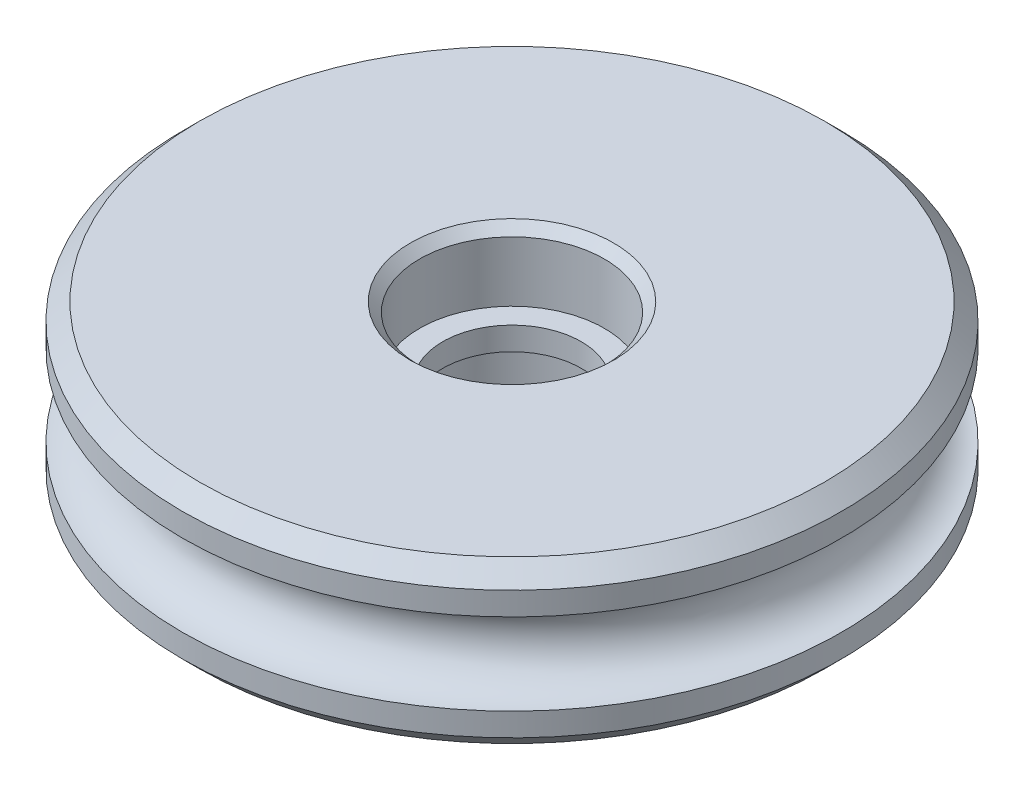
ISO-10303-21;
HEADER;
FILE_DESCRIPTION(('STEP AP214'),'2;1');
FILE_NAME('part.step','',(''),(''),'','','');
FILE_SCHEMA(('AUTOMOTIVE_DESIGN { 1 0 10303 214 1 1 1 1 }'));
ENDSEC;
DATA;
#1=APPLICATION_CONTEXT('core data for automotive mechanical design processes');
#2=APPLICATION_PROTOCOL_DEFINITION('international standard','automotive_design',2000,#1);
#3=PRODUCT_CONTEXT('',#1,'mechanical');
#4=PRODUCT('Part','Part','',(#3));
#5=PRODUCT_RELATED_PRODUCT_CATEGORY('part','',(#4));
#6=PRODUCT_DEFINITION_FORMATION('','',#4);
#7=PRODUCT_DEFINITION_CONTEXT('part definition',#1,'design');
#8=PRODUCT_DEFINITION('design','',#6,#7);
#9=PRODUCT_DEFINITION_SHAPE('','',#8);
#10=(LENGTH_UNIT() NAMED_UNIT(*) SI_UNIT(.MILLI.,.METRE.));
#11=(NAMED_UNIT(*) PLANE_ANGLE_UNIT() SI_UNIT($,.RADIAN.));
#12=(NAMED_UNIT(*) SI_UNIT($,.STERADIAN.) SOLID_ANGLE_UNIT());
#13=UNCERTAINTY_MEASURE_WITH_UNIT(LENGTH_MEASURE(1.E-05),#10,'distance_accuracy_value','');
#14=(GEOMETRIC_REPRESENTATION_CONTEXT(3) GLOBAL_UNCERTAINTY_ASSIGNED_CONTEXT((#13)) GLOBAL_UNIT_ASSIGNED_CONTEXT((#10,
#11,#12)) REPRESENTATION_CONTEXT('',''));
#15=CARTESIAN_POINT('',(0.,0.,0.));
#16=DIRECTION('',(0.,0.,1.));
#17=DIRECTION('',(1.,0.,0.));
#18=AXIS2_PLACEMENT_3D('',#15,#16,#17);
#19=CARTESIAN_POINT('',(0.,19.0174021430808,0.));
#20=DIRECTION('',(0.,1.,0.));
#21=DIRECTION('',(0.,0.,1.));
#22=AXIS2_PLACEMENT_3D('',#19,#20,#21);
#23=CYLINDRICAL_SURFACE('',#22,4.);
#24=CARTESIAN_POINT('',(0.,3.10000000000001,0.));
#25=DIRECTION('',(0.,1.,0.));
#26=DIRECTION('',(0.,0.,1.));
#27=AXIS2_PLACEMENT_3D('',#24,#25,#26);
#28=CIRCLE('',#27,4.);
#29=CARTESIAN_POINT('',(0.,3.10000000000001,4.));
#30=VERTEX_POINT('',#29);
#31=EDGE_CURVE('E62',#30,#30,#28,.T.);
#32=ORIENTED_EDGE('',*,*,#31,.T.);
#33=EDGE_LOOP('',(#32));
#34=FACE_BOUND('',#33,.T.);
#35=CARTESIAN_POINT('',(0.,0.5,0.));
#36=DIRECTION('',(0.,1.,0.));
#37=DIRECTION('',(0.,0.,1.));
#38=AXIS2_PLACEMENT_3D('',#35,#36,#37);
#39=CIRCLE('',#38,4.);
#40=CARTESIAN_POINT('',(0.,0.5,4.));
#41=VERTEX_POINT('',#40);
#42=EDGE_CURVE('E84',#41,#41,#39,.T.);
#43=ORIENTED_EDGE('',*,*,#42,.F.);
#44=EDGE_LOOP('',(#43));
#45=FACE_BOUND('',#44,.T.);
#46=ADVANCED_FACE('F43',(#34,#45),#23,.F.);
#47=CARTESIAN_POINT('',(0.,3.5,4.));
#48=DIRECTION('',(0.,1.,0.));
#49=DIRECTION('',(0.,0.,1.));
#50=AXIS2_PLACEMENT_3D('',#47,#48,#49);
#51=PLANE('',#50);
#52=CARTESIAN_POINT('',(0.,3.5,0.));
#53=DIRECTION('',(0.,1.,0.));
#54=DIRECTION('',(0.,0.,1.));
#55=AXIS2_PLACEMENT_3D('',#52,#53,#54);
#56=CIRCLE('',#55,4.4);
#57=CARTESIAN_POINT('',(0.,3.5,4.4));
#58=VERTEX_POINT('',#57);
#59=EDGE_CURVE('E57',#58,#58,#56,.F.);
#60=ORIENTED_EDGE('',*,*,#59,.T.);
#61=EDGE_LOOP('',(#60));
#62=FACE_BOUND('',#61,.T.);
#63=CARTESIAN_POINT('',(0.,3.5,0.));
#64=DIRECTION('',(0.,1.,0.));
#65=DIRECTION('',(0.,0.,1.));
#66=AXIS2_PLACEMENT_3D('',#63,#64,#65);
#67=CIRCLE('',#66,13.5274);
#68=CARTESIAN_POINT('',(0.,3.5,13.5274));
#69=VERTEX_POINT('',#68);
#70=EDGE_CURVE('E68',#69,#69,#67,.T.);
#71=ORIENTED_EDGE('',*,*,#70,.T.);
#72=EDGE_LOOP('',(#71));
#73=FACE_BOUND('',#72,.T.);
#74=ADVANCED_FACE('F135',(#62,#73),#51,.T.);
#75=CARTESIAN_POINT('',(0.,3.5,0.));
#76=DIRECTION('',(0.,-1.,0.));
#77=DIRECTION('',(0.,0.,-1.));
#78=AXIS2_PLACEMENT_3D('',#75,#76,#77);
#79=CONICAL_SURFACE('',#78,13.5274,0.785398163397453);
#80=CARTESIAN_POINT('',(0.,2.7653,0.));
#81=DIRECTION('',(0.,1.,0.));
#82=DIRECTION('',(0.,0.,1.));
#83=AXIS2_PLACEMENT_3D('',#80,#81,#82);
#84=CIRCLE('',#83,14.2621);
#85=CARTESIAN_POINT('',(0.,2.7653,14.2621));
#86=VERTEX_POINT('',#85);
#87=EDGE_CURVE('E72',#86,#86,#84,.T.);
#88=ORIENTED_EDGE('',*,*,#87,.T.);
#89=EDGE_LOOP('',(#88));
#90=FACE_BOUND('',#89,.T.);
#91=ORIENTED_EDGE('',*,*,#70,.F.);
#92=EDGE_LOOP('',(#91));
#93=FACE_BOUND('',#92,.T.);
#94=ADVANCED_FACE('F141',(#90,#93),#79,.T.);
#95=CARTESIAN_POINT('',(0.,19.0174021430808,0.));
#96=DIRECTION('',(0.,1.,0.));
#97=DIRECTION('',(0.,0.,1.));
#98=AXIS2_PLACEMENT_3D('',#95,#96,#97);
#99=CYLINDRICAL_SURFACE('',#98,14.2621);
#100=CARTESIAN_POINT('',(0.,1.7653,0.));
#101=DIRECTION('',(0.,1.,0.));
#102=DIRECTION('',(0.,0.,1.));
#103=AXIS2_PLACEMENT_3D('',#100,#101,#102);
#104=CIRCLE('',#103,14.2621);
#105=CARTESIAN_POINT('',(0.,1.7653,14.2621));
#106=VERTEX_POINT('',#105);
#107=EDGE_CURVE('E76',#106,#106,#104,.T.);
#108=ORIENTED_EDGE('',*,*,#107,.T.);
#109=EDGE_LOOP('',(#108));
#110=FACE_BOUND('',#109,.T.);
#111=ORIENTED_EDGE('',*,*,#87,.F.);
#112=EDGE_LOOP('',(#111));
#113=FACE_BOUND('',#112,.T.);
#114=ADVANCED_FACE('F131',(#110,#113),#99,.T.);
#115=CARTESIAN_POINT('',(0.,0.,0.));
#116=DIRECTION('',(0.,1.,0.));
#117=DIRECTION('',(0.,0.,1.));
#118=AXIS2_PLACEMENT_3D('',#115,#116,#117);
#119=TOROIDAL_SURFACE('',#118,14.2621,1.7653);
#120=ORIENTED_EDGE('',*,*,#107,.F.);
#121=EDGE_LOOP('',(#120));
#122=FACE_BOUND('',#121,.T.);
#123=CARTESIAN_POINT('',(0.,-1.7653,0.));
#124=DIRECTION('',(0.,1.,0.));
#125=DIRECTION('',(0.,0.,1.));
#126=AXIS2_PLACEMENT_3D('',#123,#124,#125);
#127=CIRCLE('',#126,14.2621);
#128=CARTESIAN_POINT('',(0.,-1.7653,14.2621));
#129=VERTEX_POINT('',#128);
#130=EDGE_CURVE('E96',#129,#129,#127,.T.);
#131=ORIENTED_EDGE('',*,*,#130,.T.);
#132=EDGE_LOOP('',(#131));
#133=FACE_BOUND('',#132,.T.);
#134=ADVANCED_FACE('F122',(#122,#133),#119,.F.);
#135=CARTESIAN_POINT('',(0.,19.0174021430808,0.));
#136=DIRECTION('',(0.,1.,0.));
#137=DIRECTION('',(0.,0.,1.));
#138=AXIS2_PLACEMENT_3D('',#135,#136,#137);
#139=CYLINDRICAL_SURFACE('',#138,3.);
#140=CARTESIAN_POINT('',(0.,0.5,0.));
#141=DIRECTION('',(0.,1.,0.));
#142=DIRECTION('',(0.,0.,1.));
#143=AXIS2_PLACEMENT_3D('',#140,#141,#142);
#144=CIRCLE('',#143,3.);
#145=CARTESIAN_POINT('',(0.,0.5,3.));
#146=VERTEX_POINT('',#145);
#147=EDGE_CURVE('E80',#146,#146,#144,.T.);
#148=ORIENTED_EDGE('',*,*,#147,.T.);
#149=EDGE_LOOP('',(#148));
#150=FACE_BOUND('',#149,.T.);
#151=CARTESIAN_POINT('',(0.,-0.5,0.));
#152=DIRECTION('',(0.,1.,0.));
#153=DIRECTION('',(0.,0.,1.));
#154=AXIS2_PLACEMENT_3D('',#151,#152,#153);
#155=CIRCLE('',#154,3.);
#156=CARTESIAN_POINT('',(0.,-0.5,3.));
#157=VERTEX_POINT('',#156);
#158=EDGE_CURVE('E100',#157,#157,#155,.T.);
#159=ORIENTED_EDGE('',*,*,#158,.F.);
#160=EDGE_LOOP('',(#159));
#161=FACE_BOUND('',#160,.T.);
#162=ADVANCED_FACE('F119',(#150,#161),#139,.F.);
#163=CARTESIAN_POINT('',(0.,0.5,3.));
#164=DIRECTION('',(0.,1.,0.));
#165=DIRECTION('',(0.,0.,1.));
#166=AXIS2_PLACEMENT_3D('',#163,#164,#165);
#167=PLANE('',#166);
#168=ORIENTED_EDGE('',*,*,#42,.T.);
#169=EDGE_LOOP('',(#168));
#170=FACE_BOUND('',#169,.T.);
#171=ORIENTED_EDGE('',*,*,#147,.F.);
#172=EDGE_LOOP('',(#171));
#173=FACE_BOUND('',#172,.T.);
#174=ADVANCED_FACE('F121',(#170,#173),#167,.T.);
#175=CARTESIAN_POINT('',(0.,-19.0174021430808,0.));
#176=DIRECTION('',(0.,-1.,0.));
#177=DIRECTION('',(0.,0.,1.));
#178=AXIS2_PLACEMENT_3D('',#175,#176,#177);
#179=CYLINDRICAL_SURFACE('',#178,4.);
#180=CARTESIAN_POINT('',(0.,-3.1,0.));
#181=DIRECTION('',(0.,-1.,0.));
#182=DIRECTION('',(0.,0.,-1.));
#183=AXIS2_PLACEMENT_3D('',#180,#181,#182);
#184=CIRCLE('',#183,4.);
#185=CARTESIAN_POINT('',(0.,-3.1,-4.));
#186=VERTEX_POINT('',#185);
#187=EDGE_CURVE('E10',#186,#186,#184,.T.);
#188=ORIENTED_EDGE('',*,*,#187,.T.);
#189=EDGE_LOOP('',(#188));
#190=FACE_BOUND('',#189,.T.);
#191=CARTESIAN_POINT('',(0.,-0.5,0.));
#192=DIRECTION('',(0.,1.,0.));
#193=DIRECTION('',(0.,0.,1.));
#194=AXIS2_PLACEMENT_3D('',#191,#192,#193);
#195=CIRCLE('',#194,4.);
#196=CARTESIAN_POINT('',(0.,-0.5,4.));
#197=VERTEX_POINT('',#196);
#198=EDGE_CURVE('E104',#197,#197,#195,.T.);
#199=ORIENTED_EDGE('',*,*,#198,.T.);
#200=EDGE_LOOP('',(#199));
#201=FACE_BOUND('',#200,.T.);
#202=ADVANCED_FACE('F109',(#190,#201),#179,.F.);
#203=CARTESIAN_POINT('',(0.,-3.5,4.));
#204=DIRECTION('',(0.,-1.,0.));
#205=DIRECTION('',(0.,0.,1.));
#206=AXIS2_PLACEMENT_3D('',#203,#204,#205);
#207=PLANE('',#206);
#208=CARTESIAN_POINT('',(0.,-3.5,0.));
#209=DIRECTION('',(0.,-1.,0.));
#210=DIRECTION('',(0.,0.,-1.));
#211=AXIS2_PLACEMENT_3D('',#208,#209,#210);
#212=CIRCLE('',#211,4.4);
#213=CARTESIAN_POINT('',(0.,-3.5,-4.4));
#214=VERTEX_POINT('',#213);
#215=EDGE_CURVE('E52',#214,#214,#212,.F.);
#216=ORIENTED_EDGE('',*,*,#215,.T.);
#217=EDGE_LOOP('',(#216));
#218=FACE_BOUND('',#217,.T.);
#219=CARTESIAN_POINT('',(0.,-3.5,0.));
#220=DIRECTION('',(0.,1.,0.));
#221=DIRECTION('',(0.,0.,1.));
#222=AXIS2_PLACEMENT_3D('',#219,#220,#221);
#223=CIRCLE('',#222,13.5274);
#224=CARTESIAN_POINT('',(0.,-3.5,13.5274));
#225=VERTEX_POINT('',#224);
#226=EDGE_CURVE('E88',#225,#225,#223,.T.);
#227=ORIENTED_EDGE('',*,*,#226,.F.);
#228=EDGE_LOOP('',(#227));
#229=FACE_BOUND('',#228,.T.);
#230=ADVANCED_FACE('F184',(#218,#229),#207,.T.);
#231=CARTESIAN_POINT('',(0.,-3.5,0.));
#232=DIRECTION('',(0.,1.,0.));
#233=DIRECTION('',(0.,0.,-1.));
#234=AXIS2_PLACEMENT_3D('',#231,#232,#233);
#235=CONICAL_SURFACE('',#234,13.5274,0.785398163397453);
#236=CARTESIAN_POINT('',(0.,-2.7653,0.));
#237=DIRECTION('',(0.,1.,0.));
#238=DIRECTION('',(0.,0.,1.));
#239=AXIS2_PLACEMENT_3D('',#236,#237,#238);
#240=CIRCLE('',#239,14.2621);
#241=CARTESIAN_POINT('',(0.,-2.7653,14.2621));
#242=VERTEX_POINT('',#241);
#243=EDGE_CURVE('E92',#242,#242,#240,.T.);
#244=ORIENTED_EDGE('',*,*,#243,.F.);
#245=EDGE_LOOP('',(#244));
#246=FACE_BOUND('',#245,.T.);
#247=ORIENTED_EDGE('',*,*,#226,.T.);
#248=EDGE_LOOP('',(#247));
#249=FACE_BOUND('',#248,.T.);
#250=ADVANCED_FACE('F178',(#246,#249),#235,.T.);
#251=CARTESIAN_POINT('',(0.,-19.0174021430808,0.));
#252=DIRECTION('',(0.,-1.,0.));
#253=DIRECTION('',(0.,0.,1.));
#254=AXIS2_PLACEMENT_3D('',#251,#252,#253);
#255=CYLINDRICAL_SURFACE('',#254,14.2621);
#256=ORIENTED_EDGE('',*,*,#130,.F.);
#257=EDGE_LOOP('',(#256));
#258=FACE_BOUND('',#257,.T.);
#259=ORIENTED_EDGE('',*,*,#243,.T.);
#260=EDGE_LOOP('',(#259));
#261=FACE_BOUND('',#260,.T.);
#262=ADVANCED_FACE('F115',(#258,#261),#255,.T.);
#263=CARTESIAN_POINT('',(0.,-0.5,3.));
#264=DIRECTION('',(0.,-1.,0.));
#265=DIRECTION('',(0.,0.,1.));
#266=AXIS2_PLACEMENT_3D('',#263,#264,#265);
#267=PLANE('',#266);
#268=ORIENTED_EDGE('',*,*,#198,.F.);
#269=EDGE_LOOP('',(#268));
#270=FACE_BOUND('',#269,.T.);
#271=ORIENTED_EDGE('',*,*,#158,.T.);
#272=EDGE_LOOP('',(#271));
#273=FACE_BOUND('',#272,.T.);
#274=ADVANCED_FACE('F111',(#270,#273),#267,.T.);
#275=CARTESIAN_POINT('',(0.,3.10000000000001,0.));
#276=DIRECTION('',(0.,1.,0.));
#277=DIRECTION('',(0.,0.,1.));
#278=AXIS2_PLACEMENT_3D('',#275,#276,#277);
#279=CONICAL_SURFACE('',#278,4.,0.78539816339745);
#280=ORIENTED_EDGE('',*,*,#59,.F.);
#281=EDGE_LOOP('',(#280));
#282=FACE_BOUND('',#281,.T.);
#283=ORIENTED_EDGE('',*,*,#31,.F.);
#284=EDGE_LOOP('',(#283));
#285=FACE_BOUND('',#284,.T.);
#286=ADVANCED_FACE('F114',(#282,#285),#279,.F.);
#287=CARTESIAN_POINT('',(0.,-3.5,0.));
#288=DIRECTION('',(0.,-1.,0.));
#289=DIRECTION('',(0.,0.,-1.));
#290=AXIS2_PLACEMENT_3D('',#287,#288,#289);
#291=CONICAL_SURFACE('',#290,4.4,0.785398163397446);
#292=ORIENTED_EDGE('',*,*,#187,.F.);
#293=EDGE_LOOP('',(#292));
#294=FACE_BOUND('',#293,.T.);
#295=ORIENTED_EDGE('',*,*,#215,.F.);
#296=EDGE_LOOP('',(#295));
#297=FACE_BOUND('',#296,.T.);
#298=ADVANCED_FACE('F46',(#294,#297),#291,.F.);
#299=CLOSED_SHELL('',(#46,#74,#94,#114,#134,#162,#174,#202,#230,#250,#262,#274,#286,#298));
#300=MANIFOLD_SOLID_BREP('B2',#299);
#301=ADVANCED_BREP_SHAPE_REPRESENTATION('',(#18,#300),#14);
#302=SHAPE_DEFINITION_REPRESENTATION(#9,#301);
ENDSEC;
END-ISO-10303-21;
